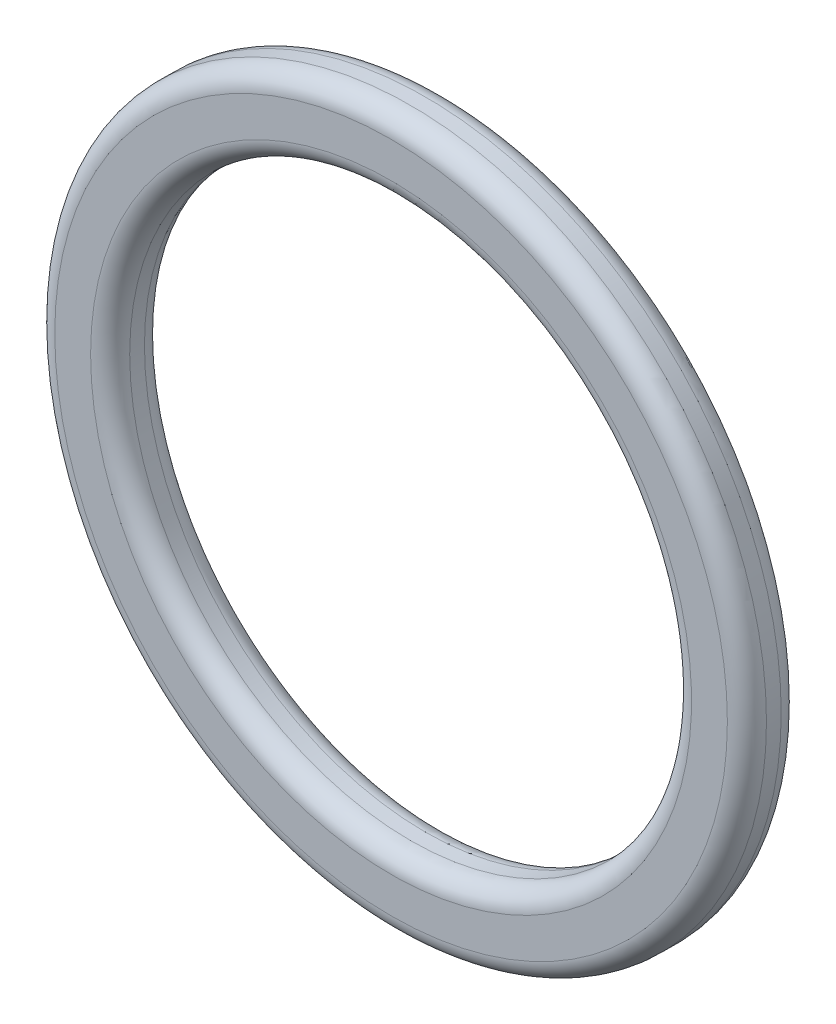
ISO-10303-21;
HEADER;
FILE_DESCRIPTION(('STEP AP214'),'2;1');
FILE_NAME('part.step','',(''),(''),'','','');
FILE_SCHEMA(('AUTOMOTIVE_DESIGN { 1 0 10303 214 1 1 1 1 }'));
ENDSEC;
DATA;
#1=APPLICATION_CONTEXT('core data for automotive mechanical design processes');
#2=APPLICATION_PROTOCOL_DEFINITION('international standard','automotive_design',2000,#1);
#3=PRODUCT_CONTEXT('',#1,'mechanical');
#4=PRODUCT('Part','Part','',(#3));
#5=PRODUCT_RELATED_PRODUCT_CATEGORY('part','',(#4));
#6=PRODUCT_DEFINITION_FORMATION('','',#4);
#7=PRODUCT_DEFINITION_CONTEXT('part definition',#1,'design');
#8=PRODUCT_DEFINITION('design','',#6,#7);
#9=PRODUCT_DEFINITION_SHAPE('','',#8);
#10=(LENGTH_UNIT() NAMED_UNIT(*) SI_UNIT(.MILLI.,.METRE.));
#11=(NAMED_UNIT(*) PLANE_ANGLE_UNIT() SI_UNIT($,.RADIAN.));
#12=(NAMED_UNIT(*) SI_UNIT($,.STERADIAN.) SOLID_ANGLE_UNIT());
#13=UNCERTAINTY_MEASURE_WITH_UNIT(LENGTH_MEASURE(1.E-05),#10,'distance_accuracy_value','');
#14=(GEOMETRIC_REPRESENTATION_CONTEXT(3) GLOBAL_UNCERTAINTY_ASSIGNED_CONTEXT((#13)) GLOBAL_UNIT_ASSIGNED_CONTEXT((#10,
#11,#12)) REPRESENTATION_CONTEXT('',''));
#15=CARTESIAN_POINT('',(0.,0.,0.));
#16=DIRECTION('',(0.,0.,1.));
#17=DIRECTION('',(1.,0.,0.));
#18=AXIS2_PLACEMENT_3D('',#15,#16,#17);
#19=CARTESIAN_POINT('',(0.,0.,1.465));
#20=DIRECTION('',(0.,0.,-1.));
#21=DIRECTION('',(-1.,0.,0.));
#22=AXIS2_PLACEMENT_3D('',#19,#20,#21);
#23=TOROIDAL_SURFACE('',#22,12.835,0.835);
#24=CARTESIAN_POINT('',(0.,0.,1.465));
#25=DIRECTION('',(0.,0.,-1.));
#26=DIRECTION('',(-1.,0.,0.));
#27=AXIS2_PLACEMENT_3D('',#24,#25,#26);
#28=CIRCLE('',#27,12.);
#29=CARTESIAN_POINT('',(-12.,0.,1.465));
#30=VERTEX_POINT('',#29);
#31=EDGE_CURVE('E58',#30,#30,#28,.T.);
#32=ORIENTED_EDGE('',*,*,#31,.T.);
#33=EDGE_LOOP('',(#32));
#34=FACE_BOUND('',#33,.T.);
#35=CARTESIAN_POINT('',(0.,0.,2.3));
#36=DIRECTION('',(0.,0.,-1.));
#37=DIRECTION('',(-1.,0.,0.));
#38=AXIS2_PLACEMENT_3D('',#35,#36,#37);
#39=CIRCLE('',#38,12.835);
#40=CARTESIAN_POINT('',(-12.835,0.,2.3));
#41=VERTEX_POINT('',#40);
#42=EDGE_CURVE('E10',#41,#41,#39,.T.);
#43=ORIENTED_EDGE('',*,*,#42,.F.);
#44=EDGE_LOOP('',(#43));
#45=FACE_BOUND('',#44,.T.);
#46=ADVANCED_FACE('F30',(#34,#45),#23,.T.);
#47=CARTESIAN_POINT('',(0.,12.835,2.3));
#48=DIRECTION('',(0.,0.,1.));
#49=DIRECTION('',(1.,0.,0.));
#50=AXIS2_PLACEMENT_3D('',#47,#48,#49);
#51=PLANE('',#50);
#52=ORIENTED_EDGE('',*,*,#42,.T.);
#53=EDGE_LOOP('',(#52));
#54=FACE_BOUND('',#53,.T.);
#55=CARTESIAN_POINT('',(0.,0.,2.3));
#56=DIRECTION('',(0.,0.,-1.));
#57=DIRECTION('',(-1.,0.,0.));
#58=AXIS2_PLACEMENT_3D('',#55,#56,#57);
#59=CIRCLE('',#58,14.365);
#60=CARTESIAN_POINT('',(-14.365,0.,2.3));
#61=VERTEX_POINT('',#60);
#62=EDGE_CURVE('E36',#61,#61,#59,.T.);
#63=ORIENTED_EDGE('',*,*,#62,.F.);
#64=EDGE_LOOP('',(#63));
#65=FACE_BOUND('',#64,.T.);
#66=ADVANCED_FACE('F76',(#54,#65),#51,.T.);
#67=CARTESIAN_POINT('',(0.,0.,1.465));
#68=DIRECTION('',(0.,0.,-1.));
#69=DIRECTION('',(-1.,0.,0.));
#70=AXIS2_PLACEMENT_3D('',#67,#68,#69);
#71=TOROIDAL_SURFACE('',#70,14.365,0.835);
#72=ORIENTED_EDGE('',*,*,#62,.T.);
#73=EDGE_LOOP('',(#72));
#74=FACE_BOUND('',#73,.T.);
#75=CARTESIAN_POINT('',(0.,0.,1.465));
#76=DIRECTION('',(0.,0.,-1.));
#77=DIRECTION('',(-1.,0.,0.));
#78=AXIS2_PLACEMENT_3D('',#75,#76,#77);
#79=CIRCLE('',#78,15.2);
#80=CARTESIAN_POINT('',(-15.2,0.,1.465));
#81=VERTEX_POINT('',#80);
#82=EDGE_CURVE('E40',#81,#81,#79,.T.);
#83=ORIENTED_EDGE('',*,*,#82,.F.);
#84=EDGE_LOOP('',(#83));
#85=FACE_BOUND('',#84,.T.);
#86=ADVANCED_FACE('F80',(#74,#85),#71,.T.);
#87=CARTESIAN_POINT('',(0.,0.,0.));
#88=DIRECTION('',(0.,0.,-1.));
#89=DIRECTION('',(-1.,0.,0.));
#90=AXIS2_PLACEMENT_3D('',#87,#88,#89);
#91=CYLINDRICAL_SURFACE('',#90,15.2);
#92=ORIENTED_EDGE('',*,*,#82,.T.);
#93=EDGE_LOOP('',(#92));
#94=FACE_BOUND('',#93,.T.);
#95=CARTESIAN_POINT('',(0.,0.,0.835));
#96=DIRECTION('',(0.,0.,-1.));
#97=DIRECTION('',(-1.,0.,0.));
#98=AXIS2_PLACEMENT_3D('',#95,#96,#97);
#99=CIRCLE('',#98,15.2);
#100=CARTESIAN_POINT('',(-15.2,0.,0.835));
#101=VERTEX_POINT('',#100);
#102=EDGE_CURVE('E44',#101,#101,#99,.T.);
#103=ORIENTED_EDGE('',*,*,#102,.F.);
#104=EDGE_LOOP('',(#103));
#105=FACE_BOUND('',#104,.T.);
#106=ADVANCED_FACE('F84',(#94,#105),#91,.T.);
#107=CARTESIAN_POINT('',(0.,0.,0.835));
#108=DIRECTION('',(0.,0.,-1.));
#109=DIRECTION('',(-1.,0.,0.));
#110=AXIS2_PLACEMENT_3D('',#107,#108,#109);
#111=TOROIDAL_SURFACE('',#110,14.365,0.835);
#112=ORIENTED_EDGE('',*,*,#102,.T.);
#113=EDGE_LOOP('',(#112));
#114=FACE_BOUND('',#113,.T.);
#115=CARTESIAN_POINT('',(0.,0.,0.));
#116=DIRECTION('',(0.,0.,-1.));
#117=DIRECTION('',(-1.,0.,0.));
#118=AXIS2_PLACEMENT_3D('',#115,#116,#117);
#119=CIRCLE('',#118,14.365);
#120=CARTESIAN_POINT('',(-14.365,0.,0.));
#121=VERTEX_POINT('',#120);
#122=EDGE_CURVE('E49',#121,#121,#119,.T.);
#123=ORIENTED_EDGE('',*,*,#122,.F.);
#124=EDGE_LOOP('',(#123));
#125=FACE_BOUND('',#124,.T.);
#126=ADVANCED_FACE('F90',(#114,#125),#111,.T.);
#127=CARTESIAN_POINT('',(0.,12.835,0.));
#128=DIRECTION('',(0.,0.,-1.));
#129=DIRECTION('',(-1.,0.,0.));
#130=AXIS2_PLACEMENT_3D('',#127,#128,#129);
#131=PLANE('',#130);
#132=ORIENTED_EDGE('',*,*,#122,.T.);
#133=EDGE_LOOP('',(#132));
#134=FACE_BOUND('',#133,.T.);
#135=CARTESIAN_POINT('',(0.,0.,0.));
#136=DIRECTION('',(0.,0.,-1.));
#137=DIRECTION('',(-1.,0.,0.));
#138=AXIS2_PLACEMENT_3D('',#135,#136,#137);
#139=CIRCLE('',#138,12.835);
#140=CARTESIAN_POINT('',(-12.835,0.,0.));
#141=VERTEX_POINT('',#140);
#142=EDGE_CURVE('E52',#141,#141,#139,.T.);
#143=ORIENTED_EDGE('',*,*,#142,.F.);
#144=EDGE_LOOP('',(#143));
#145=FACE_BOUND('',#144,.T.);
#146=ADVANCED_FACE('F72',(#134,#145),#131,.T.);
#147=CARTESIAN_POINT('',(0.,0.,0.835));
#148=DIRECTION('',(0.,0.,-1.));
#149=DIRECTION('',(-1.,0.,0.));
#150=AXIS2_PLACEMENT_3D('',#147,#148,#149);
#151=TOROIDAL_SURFACE('',#150,12.835,0.834999999999999);
#152=ORIENTED_EDGE('',*,*,#142,.T.);
#153=EDGE_LOOP('',(#152));
#154=FACE_BOUND('',#153,.T.);
#155=CARTESIAN_POINT('',(0.,0.,0.835));
#156=DIRECTION('',(0.,0.,-1.));
#157=DIRECTION('',(-1.,0.,0.));
#158=AXIS2_PLACEMENT_3D('',#155,#156,#157);
#159=CIRCLE('',#158,12.);
#160=CARTESIAN_POINT('',(-12.,0.,0.835));
#161=VERTEX_POINT('',#160);
#162=EDGE_CURVE('E55',#161,#161,#159,.T.);
#163=ORIENTED_EDGE('',*,*,#162,.F.);
#164=EDGE_LOOP('',(#163));
#165=FACE_BOUND('',#164,.T.);
#166=ADVANCED_FACE('F66',(#154,#165),#151,.T.);
#167=CARTESIAN_POINT('',(0.,0.,0.));
#168=DIRECTION('',(0.,0.,-1.));
#169=DIRECTION('',(-1.,0.,0.));
#170=AXIS2_PLACEMENT_3D('',#167,#168,#169);
#171=CYLINDRICAL_SURFACE('',#170,12.);
#172=ORIENTED_EDGE('',*,*,#162,.T.);
#173=EDGE_LOOP('',(#172));
#174=FACE_BOUND('',#173,.T.);
#175=ORIENTED_EDGE('',*,*,#31,.F.);
#176=EDGE_LOOP('',(#175));
#177=FACE_BOUND('',#176,.T.);
#178=ADVANCED_FACE('F64',(#174,#177),#171,.F.);
#179=CLOSED_SHELL('',(#46,#66,#86,#106,#126,#146,#166,#178));
#180=MANIFOLD_SOLID_BREP('B2',#179);
#181=ADVANCED_BREP_SHAPE_REPRESENTATION('',(#18,#180),#14);
#182=SHAPE_DEFINITION_REPRESENTATION(#9,#181);
ENDSEC;
END-ISO-10303-21;
